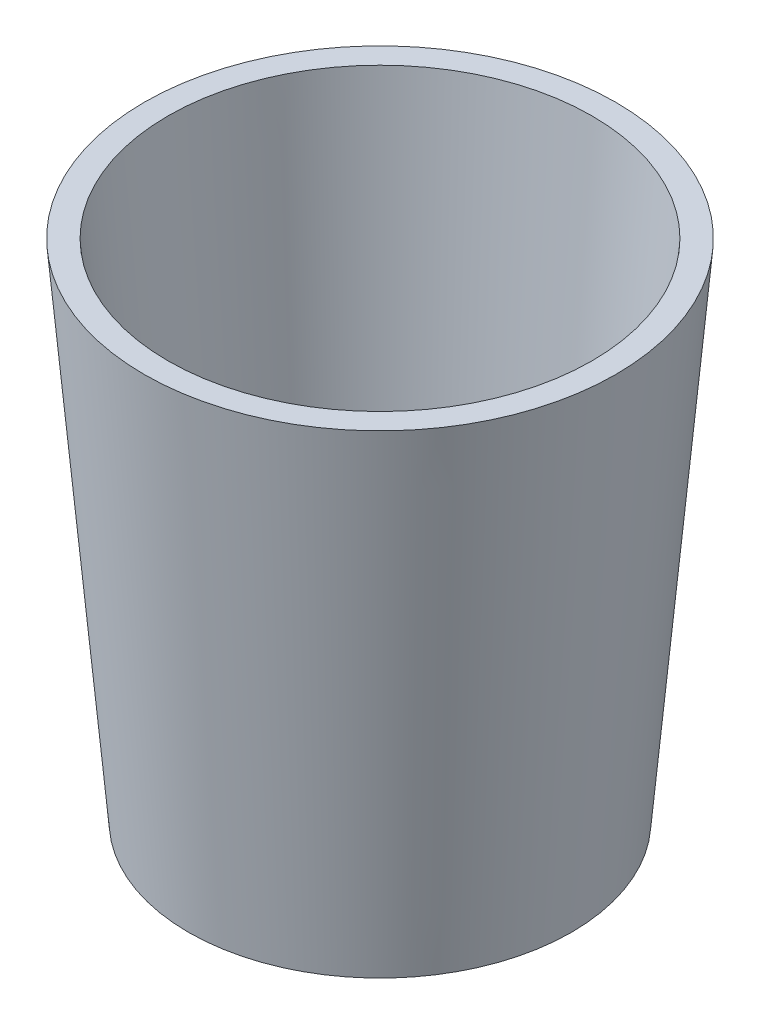
ISO-10303-21;
HEADER;
FILE_DESCRIPTION(('STEP AP214'),'2;1');
FILE_NAME('part.step','',(''),(''),'','','');
FILE_SCHEMA(('AUTOMOTIVE_DESIGN { 1 0 10303 214 1 1 1 1 }'));
ENDSEC;
DATA;
#1=APPLICATION_CONTEXT('core data for automotive mechanical design processes');
#2=APPLICATION_PROTOCOL_DEFINITION('international standard','automotive_design',2000,#1);
#3=PRODUCT_CONTEXT('',#1,'mechanical');
#4=PRODUCT('Part','Part','',(#3));
#5=PRODUCT_RELATED_PRODUCT_CATEGORY('part','',(#4));
#6=PRODUCT_DEFINITION_FORMATION('','',#4);
#7=PRODUCT_DEFINITION_CONTEXT('part definition',#1,'design');
#8=PRODUCT_DEFINITION('design','',#6,#7);
#9=PRODUCT_DEFINITION_SHAPE('','',#8);
#10=(LENGTH_UNIT() NAMED_UNIT(*) SI_UNIT(.MILLI.,.METRE.));
#11=(NAMED_UNIT(*) PLANE_ANGLE_UNIT() SI_UNIT($,.RADIAN.));
#12=(NAMED_UNIT(*) SI_UNIT($,.STERADIAN.) SOLID_ANGLE_UNIT());
#13=UNCERTAINTY_MEASURE_WITH_UNIT(LENGTH_MEASURE(1.E-05),#10,'distance_accuracy_value','');
#14=(GEOMETRIC_REPRESENTATION_CONTEXT(3) GLOBAL_UNCERTAINTY_ASSIGNED_CONTEXT((#13)) GLOBAL_UNIT_ASSIGNED_CONTEXT((#10,
#11,#12)) REPRESENTATION_CONTEXT('',''));
#15=CARTESIAN_POINT('',(0.,0.,0.));
#16=DIRECTION('',(0.,0.,1.));
#17=DIRECTION('',(1.,0.,0.));
#18=AXIS2_PLACEMENT_3D('',#15,#16,#17);
#19=CARTESIAN_POINT('',(0.,20.,-56.8767004711119));
#20=DIRECTION('',(0.,1.,0.));
#21=DIRECTION('',(0.,0.,1.));
#22=AXIS2_PLACEMENT_3D('',#19,#20,#21);
#23=CONICAL_SURFACE('',#22,51.5997348788269,0.0872664625997135);
#24=CARTESIAN_POINT('',(0.,150.,-56.8767004711119));
#25=DIRECTION('',(0.,-1.,0.));
#26=DIRECTION('',(0.,0.,-1.));
#27=AXIS2_PLACEMENT_3D('',#24,#25,#26);
#28=CIRCLE('',#27,62.9732611371966);
#29=CARTESIAN_POINT('',(0.,150.,-119.849961608309));
#30=VERTEX_POINT('',#29);
#31=EDGE_CURVE('E10',#30,#30,#28,.T.);
#32=ORIENTED_EDGE('',*,*,#31,.F.);
#33=EDGE_LOOP('',(#32));
#34=FACE_BOUND('',#33,.T.);
#35=CARTESIAN_POINT('',(0.,20.,-56.8767004711119));
#36=DIRECTION('',(0.,-1.,0.));
#37=DIRECTION('',(0.,0.,-1.));
#38=AXIS2_PLACEMENT_3D('',#35,#36,#37);
#39=CIRCLE('',#38,51.5997348788269);
#40=CARTESIAN_POINT('',(0.,20.,-108.476435349939));
#41=VERTEX_POINT('',#40);
#42=EDGE_CURVE('E54',#41,#41,#39,.T.);
#43=ORIENTED_EDGE('',*,*,#42,.T.);
#44=EDGE_LOOP('',(#43));
#45=FACE_BOUND('',#44,.T.);
#46=ADVANCED_FACE('F37',(#34,#45),#23,.F.);
#47=CARTESIAN_POINT('',(0.,150.,6.09656066608472));
#48=DIRECTION('',(0.,-1.,0.));
#49=DIRECTION('',(0.,0.,-1.));
#50=AXIS2_PLACEMENT_3D('',#47,#48,#49);
#51=PLANE('',#50);
#52=CARTESIAN_POINT('',(0.,150.,-56.8767004711119));
#53=DIRECTION('',(0.,-1.,0.));
#54=DIRECTION('',(0.,0.,-1.));
#55=AXIS2_PLACEMENT_3D('',#52,#53,#54);
#56=CIRCLE('',#55,70.);
#57=CARTESIAN_POINT('',(0.,150.,-126.876700471112));
#58=VERTEX_POINT('',#57);
#59=EDGE_CURVE('E44',#58,#58,#56,.T.);
#60=ORIENTED_EDGE('',*,*,#59,.F.);
#61=EDGE_LOOP('',(#60));
#62=FACE_BOUND('',#61,.T.);
#63=ORIENTED_EDGE('',*,*,#31,.T.);
#64=EDGE_LOOP('',(#63));
#65=FACE_BOUND('',#64,.T.);
#66=ADVANCED_FACE('F73',(#62,#65),#51,.F.);
#67=CARTESIAN_POINT('',(0.,150.,-56.8767004711119));
#68=DIRECTION('',(0.,1.,0.));
#69=DIRECTION('',(0.,0.,1.));
#70=AXIS2_PLACEMENT_3D('',#67,#68,#69);
#71=CONICAL_SURFACE('',#70,70.,0.0872664625997134);
#72=CARTESIAN_POINT('',(0.,0.,-56.8767004711119));
#73=DIRECTION('',(0.,-1.,0.));
#74=DIRECTION('',(0.,0.,-1.));
#75=AXIS2_PLACEMENT_3D('',#72,#73,#74);
#76=CIRCLE('',#75,56.8767004711119);
#77=CARTESIAN_POINT('',(0.,0.,-113.753400942224));
#78=VERTEX_POINT('',#77);
#79=EDGE_CURVE('E49',#78,#78,#76,.T.);
#80=ORIENTED_EDGE('',*,*,#79,.F.);
#81=EDGE_LOOP('',(#80));
#82=FACE_BOUND('',#81,.T.);
#83=ORIENTED_EDGE('',*,*,#59,.T.);
#84=EDGE_LOOP('',(#83));
#85=FACE_BOUND('',#84,.T.);
#86=ADVANCED_FACE('F69',(#82,#85),#71,.T.);
#87=CARTESIAN_POINT('',(0.,0.,0.));
#88=DIRECTION('',(0.,1.,0.));
#89=DIRECTION('',(0.,0.,1.));
#90=AXIS2_PLACEMENT_3D('',#87,#88,#89);
#91=PLANE('',#90);
#92=ORIENTED_EDGE('',*,*,#79,.T.);
#93=EDGE_LOOP('',(#92));
#94=FACE_BOUND('',#93,.T.);
#95=ADVANCED_FACE('F64',(#94),#91,.F.);
#96=CARTESIAN_POINT('',(0.,20.,-56.8767004711119));
#97=DIRECTION('',(0.,-1.,0.));
#98=DIRECTION('',(0.,0.,-1.));
#99=AXIS2_PLACEMENT_3D('',#96,#97,#98);
#100=PLANE('',#99);
#101=ORIENTED_EDGE('',*,*,#42,.F.);
#102=EDGE_LOOP('',(#101));
#103=FACE_BOUND('',#102,.T.);
#104=ADVANCED_FACE('F62',(#103),#100,.F.);
#105=CLOSED_SHELL('',(#46,#66,#86,#95,#104));
#106=MANIFOLD_SOLID_BREP('B2',#105);
#107=ADVANCED_BREP_SHAPE_REPRESENTATION('',(#18,#106),#14);
#108=SHAPE_DEFINITION_REPRESENTATION(#9,#107);
ENDSEC;
END-ISO-10303-21;
